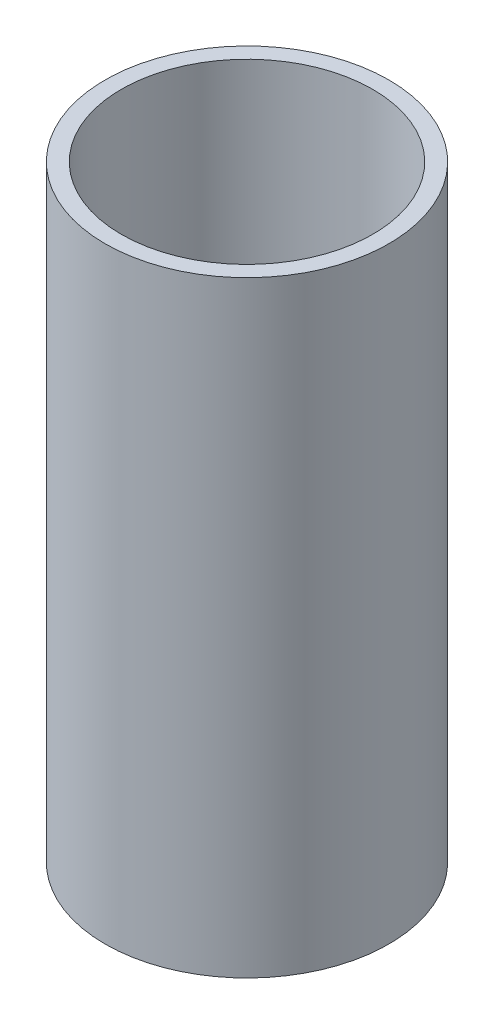
ISO-10303-21;
HEADER;
FILE_DESCRIPTION(('STEP AP214'),'2;1');
FILE_NAME('part.step','',(''),(''),'','','');
FILE_SCHEMA(('AUTOMOTIVE_DESIGN { 1 0 10303 214 1 1 1 1 }'));
ENDSEC;
DATA;
#1=APPLICATION_CONTEXT('core data for automotive mechanical design processes');
#2=APPLICATION_PROTOCOL_DEFINITION('international standard','automotive_design',2000,#1);
#3=PRODUCT_CONTEXT('',#1,'mechanical');
#4=PRODUCT('Part','Part','',(#3));
#5=PRODUCT_RELATED_PRODUCT_CATEGORY('part','',(#4));
#6=PRODUCT_DEFINITION_FORMATION('','',#4);
#7=PRODUCT_DEFINITION_CONTEXT('part definition',#1,'design');
#8=PRODUCT_DEFINITION('design','',#6,#7);
#9=PRODUCT_DEFINITION_SHAPE('','',#8);
#10=(LENGTH_UNIT() NAMED_UNIT(*) SI_UNIT(.MILLI.,.METRE.));
#11=(NAMED_UNIT(*) PLANE_ANGLE_UNIT() SI_UNIT($,.RADIAN.));
#12=(NAMED_UNIT(*) SI_UNIT($,.STERADIAN.) SOLID_ANGLE_UNIT());
#13=UNCERTAINTY_MEASURE_WITH_UNIT(LENGTH_MEASURE(1.E-05),#10,'distance_accuracy_value','');
#14=(GEOMETRIC_REPRESENTATION_CONTEXT(3) GLOBAL_UNCERTAINTY_ASSIGNED_CONTEXT((#13)) GLOBAL_UNIT_ASSIGNED_CONTEXT((#10,
#11,#12)) REPRESENTATION_CONTEXT('',''));
#15=CARTESIAN_POINT('',(0.,0.,0.));
#16=DIRECTION('',(0.,0.,1.));
#17=DIRECTION('',(1.,0.,0.));
#18=AXIS2_PLACEMENT_3D('',#15,#16,#17);
#19=CARTESIAN_POINT('',(0.,128.235622741683,0.));
#20=DIRECTION('',(0.,-1.,0.));
#21=DIRECTION('',(0.,0.,-1.));
#22=AXIS2_PLACEMENT_3D('',#19,#20,#21);
#23=CYLINDRICAL_SURFACE('',#22,30.);
#24=CARTESIAN_POINT('',(0.,128.235622741683,0.));
#25=DIRECTION('',(0.,1.,0.));
#26=DIRECTION('',(0.,0.,1.));
#27=AXIS2_PLACEMENT_3D('',#24,#25,#26);
#28=CIRCLE('',#27,30.);
#29=CARTESIAN_POINT('',(0.,128.235622741683,30.));
#30=VERTEX_POINT('',#29);
#31=EDGE_CURVE('E10',#30,#30,#28,.T.);
#32=ORIENTED_EDGE('',*,*,#31,.F.);
#33=EDGE_LOOP('',(#32));
#34=FACE_BOUND('',#33,.T.);
#35=CARTESIAN_POINT('',(0.,0.,0.));
#36=DIRECTION('',(0.,1.,0.));
#37=DIRECTION('',(0.,0.,1.));
#38=AXIS2_PLACEMENT_3D('',#35,#36,#37);
#39=CIRCLE('',#38,30.);
#40=CARTESIAN_POINT('',(0.,0.,30.));
#41=VERTEX_POINT('',#40);
#42=EDGE_CURVE('E37',#41,#41,#39,.T.);
#43=ORIENTED_EDGE('',*,*,#42,.T.);
#44=EDGE_LOOP('',(#43));
#45=FACE_BOUND('',#44,.T.);
#46=ADVANCED_FACE('F40',(#34,#45),#23,.T.);
#47=CARTESIAN_POINT('',(0.,128.235622741683,0.));
#48=DIRECTION('',(0.,1.,0.));
#49=DIRECTION('',(0.,0.,1.));
#50=AXIS2_PLACEMENT_3D('',#47,#48,#49);
#51=PLANE('',#50);
#52=CARTESIAN_POINT('',(0.,128.235622741683,0.));
#53=DIRECTION('',(0.,1.,0.));
#54=DIRECTION('',(0.,0.,1.));
#55=AXIS2_PLACEMENT_3D('',#52,#53,#54);
#56=CIRCLE('',#55,26.5741252812563);
#57=CARTESIAN_POINT('',(0.,128.235622741683,26.5741252812563));
#58=VERTEX_POINT('',#57);
#59=EDGE_CURVE('E50',#58,#58,#56,.T.);
#60=ORIENTED_EDGE('',*,*,#59,.F.);
#61=EDGE_LOOP('',(#60));
#62=FACE_BOUND('',#61,.T.);
#63=ORIENTED_EDGE('',*,*,#31,.T.);
#64=EDGE_LOOP('',(#63));
#65=FACE_BOUND('',#64,.T.);
#66=ADVANCED_FACE('F59',(#62,#65),#51,.T.);
#67=CARTESIAN_POINT('',(0.,0.,0.));
#68=DIRECTION('',(0.,1.,0.));
#69=DIRECTION('',(0.,0.,1.));
#70=AXIS2_PLACEMENT_3D('',#67,#68,#69);
#71=PLANE('',#70);
#72=CARTESIAN_POINT('',(0.,0.,0.));
#73=DIRECTION('',(0.,1.,0.));
#74=DIRECTION('',(0.,0.,1.));
#75=AXIS2_PLACEMENT_3D('',#72,#73,#74);
#76=CIRCLE('',#75,26.5741252812563);
#77=CARTESIAN_POINT('',(0.,0.,26.5741252812563));
#78=VERTEX_POINT('',#77);
#79=EDGE_CURVE('E47',#78,#78,#76,.T.);
#80=ORIENTED_EDGE('',*,*,#79,.T.);
#81=EDGE_LOOP('',(#80));
#82=FACE_BOUND('',#81,.T.);
#83=ORIENTED_EDGE('',*,*,#42,.F.);
#84=EDGE_LOOP('',(#83));
#85=FACE_BOUND('',#84,.T.);
#86=ADVANCED_FACE('F58',(#82,#85),#71,.F.);
#87=CARTESIAN_POINT('',(0.,128.235622741683,0.));
#88=DIRECTION('',(0.,-1.,0.));
#89=DIRECTION('',(0.,0.,-1.));
#90=AXIS2_PLACEMENT_3D('',#87,#88,#89);
#91=CYLINDRICAL_SURFACE('',#90,26.5741252812563);
#92=ORIENTED_EDGE('',*,*,#59,.T.);
#93=EDGE_LOOP('',(#92));
#94=FACE_BOUND('',#93,.T.);
#95=ORIENTED_EDGE('',*,*,#79,.F.);
#96=EDGE_LOOP('',(#95));
#97=FACE_BOUND('',#96,.T.);
#98=ADVANCED_FACE('F54',(#94,#97),#91,.F.);
#99=CLOSED_SHELL('',(#46,#66,#86,#98));
#100=MANIFOLD_SOLID_BREP('B2',#99);
#101=ADVANCED_BREP_SHAPE_REPRESENTATION('',(#18,#100),#14);
#102=SHAPE_DEFINITION_REPRESENTATION(#9,#101);
ENDSEC;
END-ISO-10303-21;
